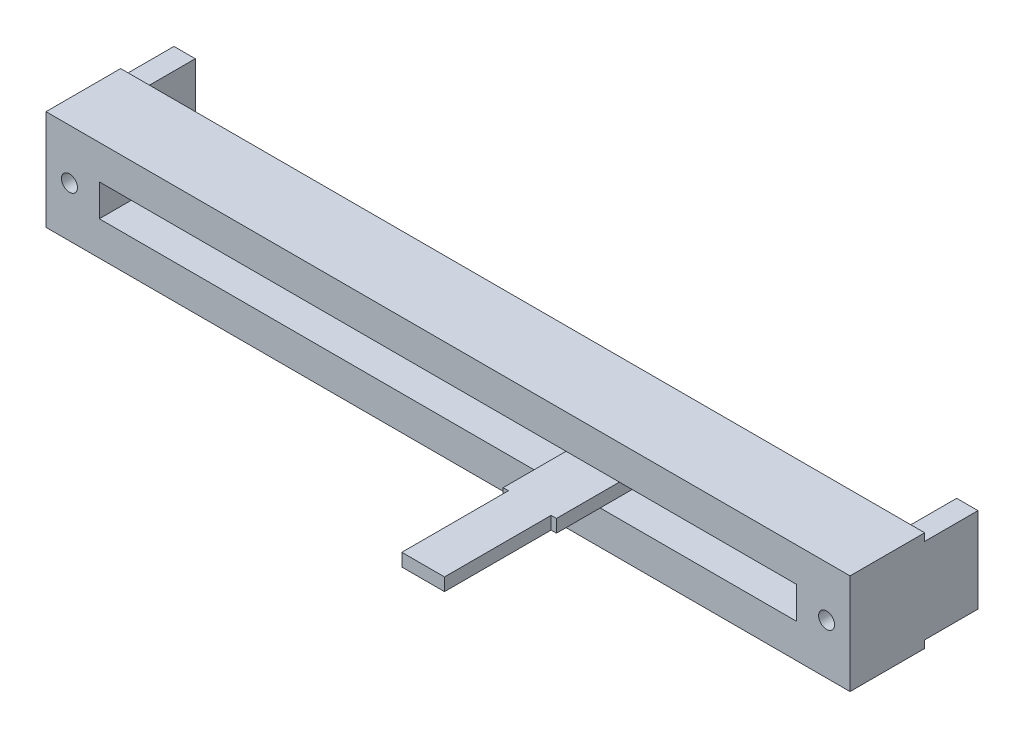
ISO-10303-21;
HEADER;
FILE_DESCRIPTION(('STEP AP214'),'2;1');
FILE_NAME('part.step','',(''),(''),'','','');
FILE_SCHEMA(('AUTOMOTIVE_DESIGN { 1 0 10303 214 1 1 1 1 }'));
ENDSEC;
DATA;
#1=APPLICATION_CONTEXT('core data for automotive mechanical design processes');
#2=APPLICATION_PROTOCOL_DEFINITION('international standard','automotive_design',2000,#1);
#3=PRODUCT_CONTEXT('',#1,'mechanical');
#4=PRODUCT('Part','Part','',(#3));
#5=PRODUCT_RELATED_PRODUCT_CATEGORY('part','',(#4));
#6=PRODUCT_DEFINITION_FORMATION('','',#4);
#7=PRODUCT_DEFINITION_CONTEXT('part definition',#1,'design');
#8=PRODUCT_DEFINITION('design','',#6,#7);
#9=PRODUCT_DEFINITION_SHAPE('','',#8);
#10=(LENGTH_UNIT() NAMED_UNIT(*) SI_UNIT(.MILLI.,.METRE.));
#11=(NAMED_UNIT(*) PLANE_ANGLE_UNIT() SI_UNIT($,.RADIAN.));
#12=(NAMED_UNIT(*) SI_UNIT($,.STERADIAN.) SOLID_ANGLE_UNIT());
#13=UNCERTAINTY_MEASURE_WITH_UNIT(LENGTH_MEASURE(1.E-05),#10,'distance_accuracy_value','');
#14=(GEOMETRIC_REPRESENTATION_CONTEXT(3) GLOBAL_UNCERTAINTY_ASSIGNED_CONTEXT((#13)) GLOBAL_UNIT_ASSIGNED_CONTEXT((#10,
#11,#12)) REPRESENTATION_CONTEXT('',''));
#15=CARTESIAN_POINT('',(0.,0.,0.));
#16=DIRECTION('',(0.,0.,1.));
#17=DIRECTION('',(1.,0.,0.));
#18=AXIS2_PLACEMENT_3D('',#15,#16,#17);
#19=CARTESIAN_POINT('',(0.,0.,0.));
#20=DIRECTION('',(0.,0.,1.));
#21=DIRECTION('',(1.,0.,0.));
#22=AXIS2_PLACEMENT_3D('',#19,#20,#21);
#23=PLANE('',#22);
#24=DIRECTION('',(1.,0.,0.));
#25=VECTOR('',#24,1.);
#26=CARTESIAN_POINT('',(-37.7,4.,0.));
#27=LINE('',#26,#25);
#28=CARTESIAN_POINT('',(-37.7,4.,0.));
#29=VERTEX_POINT('',#28);
#30=CARTESIAN_POINT('',(-35.7,4.,0.));
#31=VERTEX_POINT('',#30);
#32=EDGE_CURVE('E246',#29,#31,#27,.T.);
#33=ORIENTED_EDGE('',*,*,#32,.F.);
#34=DIRECTION('',(0.,-1.,0.));
#35=VECTOR('',#34,1.);
#36=CARTESIAN_POINT('',(-37.7,4.7,0.));
#37=LINE('',#36,#35);
#38=CARTESIAN_POINT('',(-37.7,4.7,0.));
#39=VERTEX_POINT('',#38);
#40=EDGE_CURVE('E394',#39,#29,#37,.T.);
#41=ORIENTED_EDGE('',*,*,#40,.F.);
#42=DIRECTION('',(-1.,0.,0.));
#43=VECTOR('',#42,1.);
#44=CARTESIAN_POINT('',(-37.7,4.7,0.));
#45=LINE('',#44,#43);
#46=CARTESIAN_POINT('',(37.7,4.70000000000001,0.));
#47=VERTEX_POINT('',#46);
#48=EDGE_CURVE('E384',#47,#39,#45,.T.);
#49=ORIENTED_EDGE('',*,*,#48,.F.);
#50=DIRECTION('',(0.,1.,0.));
#51=VECTOR('',#50,1.);
#52=CARTESIAN_POINT('',(37.7,4.70000000000001,0.));
#53=LINE('',#52,#51);
#54=CARTESIAN_POINT('',(37.7,4.,0.));
#55=VERTEX_POINT('',#54);
#56=EDGE_CURVE('E401',#55,#47,#53,.T.);
#57=ORIENTED_EDGE('',*,*,#56,.F.);
#58=DIRECTION('',(1.,0.,0.));
#59=VECTOR('',#58,1.);
#60=CARTESIAN_POINT('',(37.7,4.,0.));
#61=LINE('',#60,#59);
#62=CARTESIAN_POINT('',(35.7,4.,0.));
#63=VERTEX_POINT('',#62);
#64=EDGE_CURVE('E288',#63,#55,#61,.T.);
#65=ORIENTED_EDGE('',*,*,#64,.F.);
#66=DIRECTION('',(0.,1.,0.));
#67=VECTOR('',#66,1.);
#68=CARTESIAN_POINT('',(35.7,4.,0.));
#69=LINE('',#68,#67);
#70=CARTESIAN_POINT('',(35.7,-4.,0.));
#71=VERTEX_POINT('',#70);
#72=EDGE_CURVE('E301',#71,#63,#69,.T.);
#73=ORIENTED_EDGE('',*,*,#72,.F.);
#74=DIRECTION('',(-1.,0.,0.));
#75=VECTOR('',#74,1.);
#76=CARTESIAN_POINT('',(37.7,-4.,0.));
#77=LINE('',#76,#75);
#78=CARTESIAN_POINT('',(37.7,-4.,0.));
#79=VERTEX_POINT('',#78);
#80=EDGE_CURVE('E282',#79,#71,#77,.T.);
#81=ORIENTED_EDGE('',*,*,#80,.F.);
#82=CARTESIAN_POINT('',(37.7,-4.69999999999999,0.));
#83=VERTEX_POINT('',#82);
#84=EDGE_CURVE('E402',#83,#79,#53,.T.);
#85=ORIENTED_EDGE('',*,*,#84,.F.);
#86=DIRECTION('',(1.,0.,0.));
#87=VECTOR('',#86,1.);
#88=CARTESIAN_POINT('',(-37.7,-4.7,0.));
#89=LINE('',#88,#87);
#90=CARTESIAN_POINT('',(-37.7,-4.7,0.));
#91=VERTEX_POINT('',#90);
#92=EDGE_CURVE('E398',#91,#83,#89,.T.);
#93=ORIENTED_EDGE('',*,*,#92,.F.);
#94=CARTESIAN_POINT('',(-37.7,-4.,0.));
#95=VERTEX_POINT('',#94);
#96=EDGE_CURVE('E371',#95,#91,#37,.T.);
#97=ORIENTED_EDGE('',*,*,#96,.F.);
#98=DIRECTION('',(-1.,0.,0.));
#99=VECTOR('',#98,1.);
#100=CARTESIAN_POINT('',(-37.7,-4.,0.));
#101=LINE('',#100,#99);
#102=CARTESIAN_POINT('',(-35.7,-4.,0.));
#103=VERTEX_POINT('',#102);
#104=EDGE_CURVE('E260',#103,#95,#101,.T.);
#105=ORIENTED_EDGE('',*,*,#104,.F.);
#106=DIRECTION('',(0.,-1.,0.));
#107=VECTOR('',#106,1.);
#108=CARTESIAN_POINT('',(-35.7,4.,0.));
#109=LINE('',#108,#107);
#110=EDGE_CURVE('E249',#31,#103,#109,.T.);
#111=ORIENTED_EDGE('',*,*,#110,.F.);
#112=EDGE_LOOP('',(#33,#41,#49,#57,#65,#73,#81,#85,#93,#97,#105,#111));
#113=FACE_BOUND('',#112,.T.);
#114=ADVANCED_FACE('F40',(#113),#23,.F.);
#115=CARTESIAN_POINT('',(-37.7,4.7,7.));
#116=DIRECTION('',(1.,0.,0.));
#117=DIRECTION('',(0.,0.,-1.));
#118=AXIS2_PLACEMENT_3D('',#115,#116,#117);
#119=PLANE('',#118);
#120=ORIENTED_EDGE('',*,*,#40,.T.);
#121=DIRECTION('',(0.,0.,1.));
#122=VECTOR('',#121,1.);
#123=CARTESIAN_POINT('',(-37.7,4.,-5.));
#124=LINE('',#123,#122);
#125=CARTESIAN_POINT('',(-37.7,4.,-5.));
#126=VERTEX_POINT('',#125);
#127=EDGE_CURVE('E279',#126,#29,#124,.T.);
#128=ORIENTED_EDGE('',*,*,#127,.F.);
#129=DIRECTION('',(0.,1.,0.));
#130=VECTOR('',#129,1.);
#131=CARTESIAN_POINT('',(-37.7,4.,-5.));
#132=LINE('',#131,#130);
#133=CARTESIAN_POINT('',(-37.7,-4.,-5.));
#134=VERTEX_POINT('',#133);
#135=EDGE_CURVE('E255',#134,#126,#132,.T.);
#136=ORIENTED_EDGE('',*,*,#135,.F.);
#137=DIRECTION('',(0.,0.,1.));
#138=VECTOR('',#137,1.);
#139=CARTESIAN_POINT('',(-37.7,-4.,-5.));
#140=LINE('',#139,#138);
#141=EDGE_CURVE('E64',#134,#95,#140,.T.);
#142=ORIENTED_EDGE('',*,*,#141,.T.);
#143=ORIENTED_EDGE('',*,*,#96,.T.);
#144=DIRECTION('',(0.,0.,-1.));
#145=VECTOR('',#144,1.);
#146=CARTESIAN_POINT('',(-37.7,-4.7,7.));
#147=LINE('',#146,#145);
#148=CARTESIAN_POINT('',(-37.7,-4.7,7.));
#149=VERTEX_POINT('',#148);
#150=EDGE_CURVE('E419',#149,#91,#147,.T.);
#151=ORIENTED_EDGE('',*,*,#150,.F.);
#152=DIRECTION('',(0.,-1.,0.));
#153=VECTOR('',#152,1.);
#154=CARTESIAN_POINT('',(-37.7,4.7,7.));
#155=LINE('',#154,#153);
#156=CARTESIAN_POINT('',(-37.7,4.7,7.));
#157=VERTEX_POINT('',#156);
#158=EDGE_CURVE('E380',#157,#149,#155,.T.);
#159=ORIENTED_EDGE('',*,*,#158,.F.);
#160=DIRECTION('',(0.,0.,-1.));
#161=VECTOR('',#160,1.);
#162=CARTESIAN_POINT('',(-37.7,4.7,7.));
#163=LINE('',#162,#161);
#164=EDGE_CURVE('E393',#157,#39,#163,.T.);
#165=ORIENTED_EDGE('',*,*,#164,.T.);
#166=EDGE_LOOP('',(#120,#128,#136,#142,#143,#151,#159,#165));
#167=FACE_BOUND('',#166,.T.);
#168=ADVANCED_FACE('F42',(#167),#119,.F.);
#169=CARTESIAN_POINT('',(-37.7,-4.7,7.));
#170=DIRECTION('',(0.,1.,0.));
#171=DIRECTION('',(-1.,0.,0.));
#172=AXIS2_PLACEMENT_3D('',#169,#170,#171);
#173=PLANE('',#172);
#174=ORIENTED_EDGE('',*,*,#92,.T.);
#175=DIRECTION('',(0.,0.,-1.));
#176=VECTOR('',#175,1.);
#177=CARTESIAN_POINT('',(37.7,-4.69999999999999,7.));
#178=LINE('',#177,#176);
#179=CARTESIAN_POINT('',(37.7,-4.69999999999999,7.));
#180=VERTEX_POINT('',#179);
#181=EDGE_CURVE('E415',#180,#83,#178,.T.);
#182=ORIENTED_EDGE('',*,*,#181,.F.);
#183=DIRECTION('',(1.,0.,0.));
#184=VECTOR('',#183,1.);
#185=CARTESIAN_POINT('',(-37.7,-4.7,7.));
#186=LINE('',#185,#184);
#187=EDGE_CURVE('E383',#149,#180,#186,.T.);
#188=ORIENTED_EDGE('',*,*,#187,.F.);
#189=ORIENTED_EDGE('',*,*,#150,.T.);
#190=EDGE_LOOP('',(#174,#182,#188,#189));
#191=FACE_BOUND('',#190,.T.);
#192=ADVANCED_FACE('F498',(#191),#173,.F.);
#193=CARTESIAN_POINT('',(37.7,4.70000000000001,7.));
#194=DIRECTION('',(-1.,0.,0.));
#195=DIRECTION('',(0.,0.,1.));
#196=AXIS2_PLACEMENT_3D('',#193,#194,#195);
#197=PLANE('',#196);
#198=ORIENTED_EDGE('',*,*,#84,.T.);
#199=DIRECTION('',(0.,0.,1.));
#200=VECTOR('',#199,1.);
#201=CARTESIAN_POINT('',(37.7,-4.,-5.));
#202=LINE('',#201,#200);
#203=CARTESIAN_POINT('',(37.7,-4.,-5.));
#204=VERTEX_POINT('',#203);
#205=EDGE_CURVE('E319',#204,#79,#202,.T.);
#206=ORIENTED_EDGE('',*,*,#205,.F.);
#207=DIRECTION('',(0.,-1.,0.));
#208=VECTOR('',#207,1.);
#209=CARTESIAN_POINT('',(37.7,4.,-5.));
#210=LINE('',#209,#208);
#211=CARTESIAN_POINT('',(37.7,4.,-5.));
#212=VERTEX_POINT('',#211);
#213=EDGE_CURVE('E283',#212,#204,#210,.T.);
#214=ORIENTED_EDGE('',*,*,#213,.F.);
#215=DIRECTION('',(0.,0.,1.));
#216=VECTOR('',#215,1.);
#217=CARTESIAN_POINT('',(37.7,4.,-5.));
#218=LINE('',#217,#216);
#219=EDGE_CURVE('E297',#212,#55,#218,.T.);
#220=ORIENTED_EDGE('',*,*,#219,.T.);
#221=ORIENTED_EDGE('',*,*,#56,.T.);
#222=DIRECTION('',(0.,0.,-1.));
#223=VECTOR('',#222,1.);
#224=CARTESIAN_POINT('',(37.7,4.70000000000001,7.));
#225=LINE('',#224,#223);
#226=CARTESIAN_POINT('',(37.7,4.70000000000001,7.));
#227=VERTEX_POINT('',#226);
#228=EDGE_CURVE('E411',#227,#47,#225,.T.);
#229=ORIENTED_EDGE('',*,*,#228,.F.);
#230=DIRECTION('',(0.,1.,0.));
#231=VECTOR('',#230,1.);
#232=CARTESIAN_POINT('',(37.7,4.70000000000001,7.));
#233=LINE('',#232,#231);
#234=EDGE_CURVE('E387',#180,#227,#233,.T.);
#235=ORIENTED_EDGE('',*,*,#234,.F.);
#236=ORIENTED_EDGE('',*,*,#181,.T.);
#237=EDGE_LOOP('',(#198,#206,#214,#220,#221,#229,#235,#236));
#238=FACE_BOUND('',#237,.T.);
#239=ADVANCED_FACE('F507',(#238),#197,.F.);
#240=CARTESIAN_POINT('',(-37.7,4.7,7.));
#241=DIRECTION('',(0.,-1.,0.));
#242=DIRECTION('',(1.,0.,0.));
#243=AXIS2_PLACEMENT_3D('',#240,#241,#242);
#244=PLANE('',#243);
#245=ORIENTED_EDGE('',*,*,#48,.T.);
#246=ORIENTED_EDGE('',*,*,#164,.F.);
#247=DIRECTION('',(-1.,0.,0.));
#248=VECTOR('',#247,1.);
#249=CARTESIAN_POINT('',(-37.7,4.7,7.));
#250=LINE('',#249,#248);
#251=EDGE_CURVE('E390',#227,#157,#250,.T.);
#252=ORIENTED_EDGE('',*,*,#251,.F.);
#253=ORIENTED_EDGE('',*,*,#228,.T.);
#254=EDGE_LOOP('',(#245,#246,#252,#253));
#255=FACE_BOUND('',#254,.T.);
#256=ADVANCED_FACE('F504',(#255),#244,.F.);
#257=CARTESIAN_POINT('',(0.,0.,7.));
#258=DIRECTION('',(0.,0.,1.));
#259=DIRECTION('',(1.,0.,0.));
#260=AXIS2_PLACEMENT_3D('',#257,#258,#259);
#261=PLANE('',#260);
#262=CARTESIAN_POINT('',(-35.5,0.,7.));
#263=DIRECTION('',(0.,0.,1.));
#264=DIRECTION('',(1.,0.,0.));
#265=AXIS2_PLACEMENT_3D('',#262,#263,#264);
#266=CIRCLE('',#265,0.749999999999999);
#267=CARTESIAN_POINT('',(-34.75,0.,7.));
#268=VERTEX_POINT('',#267);
#269=EDGE_CURVE('E328',#268,#268,#266,.T.);
#270=ORIENTED_EDGE('',*,*,#269,.F.);
#271=EDGE_LOOP('',(#270));
#272=FACE_BOUND('',#271,.T.);
#273=CARTESIAN_POINT('',(35.5,0.,7.));
#274=DIRECTION('',(0.,0.,1.));
#275=DIRECTION('',(1.,0.,0.));
#276=AXIS2_PLACEMENT_3D('',#273,#274,#275);
#277=CIRCLE('',#276,0.749999999999999);
#278=CARTESIAN_POINT('',(36.25,0.,7.));
#279=VERTEX_POINT('',#278);
#280=EDGE_CURVE('E323',#279,#279,#277,.T.);
#281=ORIENTED_EDGE('',*,*,#280,.F.);
#282=EDGE_LOOP('',(#281));
#283=FACE_BOUND('',#282,.T.);
#284=DIRECTION('',(0.,-1.,0.));
#285=VECTOR('',#284,1.);
#286=CARTESIAN_POINT('',(-32.7,1.5,7.));
#287=LINE('',#286,#285);
#288=CARTESIAN_POINT('',(-32.7,1.5,7.));
#289=VERTEX_POINT('',#288);
#290=CARTESIAN_POINT('',(-32.7,-1.5,7.));
#291=VERTEX_POINT('',#290);
#292=EDGE_CURVE('E327',#289,#291,#287,.T.);
#293=ORIENTED_EDGE('',*,*,#292,.F.);
#294=DIRECTION('',(-1.,0.,0.));
#295=VECTOR('',#294,1.);
#296=CARTESIAN_POINT('',(-32.7,1.5,7.));
#297=LINE('',#296,#295);
#298=CARTESIAN_POINT('',(32.7,1.49999999999999,7.));
#299=VERTEX_POINT('',#298);
#300=EDGE_CURVE('E343',#299,#289,#297,.T.);
#301=ORIENTED_EDGE('',*,*,#300,.F.);
#302=DIRECTION('',(0.,1.,0.));
#303=VECTOR('',#302,1.);
#304=CARTESIAN_POINT('',(32.7,1.49999999999999,7.));
#305=LINE('',#304,#303);
#306=CARTESIAN_POINT('',(32.7,-1.49999999999999,7.));
#307=VERTEX_POINT('',#306);
#308=EDGE_CURVE('E361',#307,#299,#305,.T.);
#309=ORIENTED_EDGE('',*,*,#308,.F.);
#310=DIRECTION('',(1.,0.,0.));
#311=VECTOR('',#310,1.);
#312=CARTESIAN_POINT('',(-32.7,-1.5,7.));
#313=LINE('',#312,#311);
#314=EDGE_CURVE('E357',#291,#307,#313,.T.);
#315=ORIENTED_EDGE('',*,*,#314,.F.);
#316=EDGE_LOOP('',(#293,#301,#309,#315));
#317=FACE_BOUND('',#316,.T.);
#318=ORIENTED_EDGE('',*,*,#158,.T.);
#319=ORIENTED_EDGE('',*,*,#187,.T.);
#320=ORIENTED_EDGE('',*,*,#234,.T.);
#321=ORIENTED_EDGE('',*,*,#251,.T.);
#322=EDGE_LOOP('',(#318,#319,#320,#321));
#323=FACE_BOUND('',#322,.T.);
#324=ADVANCED_FACE('F502',(#272,#283,#317,#323),#261,.T.);
#325=CARTESIAN_POINT('',(-32.7,1.5,2.));
#326=DIRECTION('',(-1.,0.,0.));
#327=DIRECTION('',(0.,0.,1.));
#328=AXIS2_PLACEMENT_3D('',#325,#326,#327);
#329=PLANE('',#328);
#330=ORIENTED_EDGE('',*,*,#292,.T.);
#331=DIRECTION('',(0.,0.,1.));
#332=VECTOR('',#331,1.);
#333=CARTESIAN_POINT('',(-32.7,-1.5,2.));
#334=LINE('',#333,#332);
#335=CARTESIAN_POINT('',(-32.7,-1.5,2.));
#336=VERTEX_POINT('',#335);
#337=EDGE_CURVE('E355',#336,#291,#334,.T.);
#338=ORIENTED_EDGE('',*,*,#337,.F.);
#339=DIRECTION('',(0.,-1.,0.));
#340=VECTOR('',#339,1.);
#341=CARTESIAN_POINT('',(-32.7,1.5,2.));
#342=LINE('',#341,#340);
#343=CARTESIAN_POINT('',(-32.7,1.5,2.));
#344=VERTEX_POINT('',#343);
#345=EDGE_CURVE('E338',#344,#336,#342,.T.);
#346=ORIENTED_EDGE('',*,*,#345,.F.);
#347=DIRECTION('',(0.,0.,1.));
#348=VECTOR('',#347,1.);
#349=CARTESIAN_POINT('',(-32.7,1.5,2.));
#350=LINE('',#349,#348);
#351=EDGE_CURVE('E368',#344,#289,#350,.T.);
#352=ORIENTED_EDGE('',*,*,#351,.T.);
#353=EDGE_LOOP('',(#330,#338,#346,#352));
#354=FACE_BOUND('',#353,.T.);
#355=ADVANCED_FACE('F546',(#354),#329,.F.);
#356=CARTESIAN_POINT('',(-32.7,1.5,2.));
#357=DIRECTION('',(0.,1.,0.));
#358=DIRECTION('',(-1.,0.,0.));
#359=AXIS2_PLACEMENT_3D('',#356,#357,#358);
#360=PLANE('',#359);
#361=ORIENTED_EDGE('',*,*,#300,.T.);
#362=ORIENTED_EDGE('',*,*,#351,.F.);
#363=DIRECTION('',(-1.,0.,0.));
#364=VECTOR('',#363,1.);
#365=CARTESIAN_POINT('',(-32.7,1.5,2.));
#366=LINE('',#365,#364);
#367=CARTESIAN_POINT('',(32.7,1.49999999999999,2.));
#368=VERTEX_POINT('',#367);
#369=EDGE_CURVE('E351',#368,#344,#366,.T.);
#370=ORIENTED_EDGE('',*,*,#369,.F.);
#371=DIRECTION('',(0.,0.,1.));
#372=VECTOR('',#371,1.);
#373=CARTESIAN_POINT('',(32.7,1.49999999999999,2.));
#374=LINE('',#373,#372);
#375=EDGE_CURVE('E372',#368,#299,#374,.T.);
#376=ORIENTED_EDGE('',*,*,#375,.T.);
#377=EDGE_LOOP('',(#361,#362,#370,#376));
#378=FACE_BOUND('',#377,.T.);
#379=ADVANCED_FACE('F551',(#378),#360,.F.);
#380=CARTESIAN_POINT('',(32.7,1.49999999999999,2.));
#381=DIRECTION('',(1.,0.,0.));
#382=DIRECTION('',(0.,0.,-1.));
#383=AXIS2_PLACEMENT_3D('',#380,#381,#382);
#384=PLANE('',#383);
#385=ORIENTED_EDGE('',*,*,#308,.T.);
#386=ORIENTED_EDGE('',*,*,#375,.F.);
#387=DIRECTION('',(0.,1.,0.));
#388=VECTOR('',#387,1.);
#389=CARTESIAN_POINT('',(32.7,1.49999999999999,2.));
#390=LINE('',#389,#388);
#391=CARTESIAN_POINT('',(32.7,-1.49999999999999,2.));
#392=VERTEX_POINT('',#391);
#393=EDGE_CURVE('E347',#392,#368,#390,.T.);
#394=ORIENTED_EDGE('',*,*,#393,.F.);
#395=DIRECTION('',(0.,0.,1.));
#396=VECTOR('',#395,1.);
#397=CARTESIAN_POINT('',(32.7,-1.49999999999999,2.));
#398=LINE('',#397,#396);
#399=EDGE_CURVE('E375',#392,#307,#398,.T.);
#400=ORIENTED_EDGE('',*,*,#399,.T.);
#401=EDGE_LOOP('',(#385,#386,#394,#400));
#402=FACE_BOUND('',#401,.T.);
#403=ADVANCED_FACE('F569',(#402),#384,.F.);
#404=CARTESIAN_POINT('',(-32.7,-1.5,2.));
#405=DIRECTION('',(0.,-1.,0.));
#406=DIRECTION('',(1.,0.,0.));
#407=AXIS2_PLACEMENT_3D('',#404,#405,#406);
#408=PLANE('',#407);
#409=ORIENTED_EDGE('',*,*,#314,.T.);
#410=ORIENTED_EDGE('',*,*,#399,.F.);
#411=DIRECTION('',(1.,0.,0.));
#412=VECTOR('',#411,1.);
#413=CARTESIAN_POINT('',(-32.7,-1.5,2.));
#414=LINE('',#413,#412);
#415=EDGE_CURVE('E342',#336,#392,#414,.T.);
#416=ORIENTED_EDGE('',*,*,#415,.F.);
#417=ORIENTED_EDGE('',*,*,#337,.T.);
#418=EDGE_LOOP('',(#409,#410,#416,#417));
#419=FACE_BOUND('',#418,.T.);
#420=ADVANCED_FACE('F564',(#419),#408,.F.);
#421=CARTESIAN_POINT('',(0.,0.,2.));
#422=DIRECTION('',(0.,0.,1.));
#423=DIRECTION('',(1.,0.,0.));
#424=AXIS2_PLACEMENT_3D('',#421,#422,#423);
#425=PLANE('',#424);
#426=DIRECTION('',(-1.,0.,0.));
#427=VECTOR('',#426,1.);
#428=CARTESIAN_POINT('',(0.,0.6,2.));
#429=LINE('',#428,#427);
#430=CARTESIAN_POINT('',(15.1693235158385,0.6,2.));
#431=VERTEX_POINT('',#430);
#432=CARTESIAN_POINT('',(10.1693235158385,0.6,2.));
#433=VERTEX_POINT('',#432);
#434=EDGE_CURVE('E11',#431,#433,#429,.T.);
#435=ORIENTED_EDGE('',*,*,#434,.F.);
#436=DIRECTION('',(0.,-1.,0.));
#437=VECTOR('',#436,1.);
#438=CARTESIAN_POINT('',(15.1693235158385,0.,2.));
#439=LINE('',#438,#437);
#440=CARTESIAN_POINT('',(15.1693235158385,-0.6,2.));
#441=VERTEX_POINT('',#440);
#442=EDGE_CURVE('E426',#431,#441,#439,.T.);
#443=ORIENTED_EDGE('',*,*,#442,.T.);
#444=DIRECTION('',(-1.,0.,0.));
#445=VECTOR('',#444,1.);
#446=CARTESIAN_POINT('',(0.,-0.6,2.));
#447=LINE('',#446,#445);
#448=CARTESIAN_POINT('',(10.1693235158385,-0.6,2.));
#449=VERTEX_POINT('',#448);
#450=EDGE_CURVE('E422',#441,#449,#447,.T.);
#451=ORIENTED_EDGE('',*,*,#450,.T.);
#452=DIRECTION('',(0.,1.,0.));
#453=VECTOR('',#452,1.);
#454=CARTESIAN_POINT('',(10.1693235158385,0.,2.));
#455=LINE('',#454,#453);
#456=EDGE_CURVE('E49',#449,#433,#455,.T.);
#457=ORIENTED_EDGE('',*,*,#456,.T.);
#458=EDGE_LOOP('',(#435,#443,#451,#457));
#459=FACE_BOUND('',#458,.T.);
#460=ORIENTED_EDGE('',*,*,#345,.T.);
#461=ORIENTED_EDGE('',*,*,#415,.T.);
#462=ORIENTED_EDGE('',*,*,#393,.T.);
#463=ORIENTED_EDGE('',*,*,#369,.T.);
#464=EDGE_LOOP('',(#460,#461,#462,#463));
#465=FACE_BOUND('',#464,.T.);
#466=ADVANCED_FACE('F430',(#459,#465),#425,.T.);
#467=CARTESIAN_POINT('',(35.5,0.,2.));
#468=DIRECTION('',(0.,0.,1.));
#469=DIRECTION('',(1.,0.,0.));
#470=AXIS2_PLACEMENT_3D('',#467,#468,#469);
#471=CYLINDRICAL_SURFACE('',#470,0.749999999999999);
#472=CARTESIAN_POINT('',(35.5,0.,2.));
#473=DIRECTION('',(0.,0.,1.));
#474=DIRECTION('',(1.,0.,0.));
#475=AXIS2_PLACEMENT_3D('',#472,#473,#474);
#476=CIRCLE('',#475,0.749999999999999);
#477=CARTESIAN_POINT('',(36.25,0.,2.));
#478=VERTEX_POINT('',#477);
#479=EDGE_CURVE('E331',#478,#478,#476,.T.);
#480=ORIENTED_EDGE('',*,*,#479,.F.);
#481=EDGE_LOOP('',(#480));
#482=FACE_BOUND('',#481,.T.);
#483=ORIENTED_EDGE('',*,*,#280,.T.);
#484=EDGE_LOOP('',(#483));
#485=FACE_BOUND('',#484,.T.);
#486=ADVANCED_FACE('F581',(#482,#485),#471,.F.);
#487=CARTESIAN_POINT('',(35.5,0.,2.));
#488=DIRECTION('',(0.,0.,1.));
#489=DIRECTION('',(1.,0.,0.));
#490=AXIS2_PLACEMENT_3D('',#487,#488,#489);
#491=PLANE('',#490);
#492=ORIENTED_EDGE('',*,*,#479,.T.);
#493=EDGE_LOOP('',(#492));
#494=FACE_BOUND('',#493,.T.);
#495=ADVANCED_FACE('F584',(#494),#491,.T.);
#496=CARTESIAN_POINT('',(-35.5,0.,2.));
#497=DIRECTION('',(0.,0.,1.));
#498=DIRECTION('',(1.,0.,0.));
#499=AXIS2_PLACEMENT_3D('',#496,#497,#498);
#500=CYLINDRICAL_SURFACE('',#499,0.749999999999999);
#501=CARTESIAN_POINT('',(-35.5,0.,2.));
#502=DIRECTION('',(0.,0.,1.));
#503=DIRECTION('',(1.,0.,0.));
#504=AXIS2_PLACEMENT_3D('',#501,#502,#503);
#505=CIRCLE('',#504,0.749999999999999);
#506=CARTESIAN_POINT('',(-34.75,0.,2.));
#507=VERTEX_POINT('',#506);
#508=EDGE_CURVE('E324',#507,#507,#505,.T.);
#509=ORIENTED_EDGE('',*,*,#508,.F.);
#510=EDGE_LOOP('',(#509));
#511=FACE_BOUND('',#510,.T.);
#512=ORIENTED_EDGE('',*,*,#269,.T.);
#513=EDGE_LOOP('',(#512));
#514=FACE_BOUND('',#513,.T.);
#515=ADVANCED_FACE('F588',(#511,#514),#500,.F.);
#516=CARTESIAN_POINT('',(-35.5,0.,2.));
#517=DIRECTION('',(0.,0.,1.));
#518=DIRECTION('',(1.,0.,0.));
#519=AXIS2_PLACEMENT_3D('',#516,#517,#518);
#520=PLANE('',#519);
#521=ORIENTED_EDGE('',*,*,#508,.T.);
#522=EDGE_LOOP('',(#521));
#523=FACE_BOUND('',#522,.T.);
#524=ADVANCED_FACE('F592',(#523),#520,.T.);
#525=CARTESIAN_POINT('',(37.7,-4.,-5.));
#526=DIRECTION('',(0.,1.,0.));
#527=DIRECTION('',(0.,0.,1.));
#528=AXIS2_PLACEMENT_3D('',#525,#526,#527);
#529=PLANE('',#528);
#530=ORIENTED_EDGE('',*,*,#80,.T.);
#531=DIRECTION('',(0.,0.,1.));
#532=VECTOR('',#531,1.);
#533=CARTESIAN_POINT('',(35.7,-4.,-5.));
#534=LINE('',#533,#532);
#535=CARTESIAN_POINT('',(35.7,-4.,-5.));
#536=VERTEX_POINT('',#535);
#537=EDGE_CURVE('E315',#536,#71,#534,.T.);
#538=ORIENTED_EDGE('',*,*,#537,.F.);
#539=DIRECTION('',(-1.,0.,0.));
#540=VECTOR('',#539,1.);
#541=CARTESIAN_POINT('',(37.7,-4.,-5.));
#542=LINE('',#541,#540);
#543=EDGE_CURVE('E287',#204,#536,#542,.T.);
#544=ORIENTED_EDGE('',*,*,#543,.F.);
#545=ORIENTED_EDGE('',*,*,#205,.T.);
#546=EDGE_LOOP('',(#530,#538,#544,#545));
#547=FACE_BOUND('',#546,.T.);
#548=ADVANCED_FACE('F525',(#547),#529,.F.);
#549=CARTESIAN_POINT('',(35.7,4.,-5.));
#550=DIRECTION('',(1.,0.,0.));
#551=DIRECTION('',(0.,0.,-1.));
#552=AXIS2_PLACEMENT_3D('',#549,#550,#551);
#553=PLANE('',#552);
#554=ORIENTED_EDGE('',*,*,#72,.T.);
#555=DIRECTION('',(0.,0.,1.));
#556=VECTOR('',#555,1.);
#557=CARTESIAN_POINT('',(35.7,4.,-5.));
#558=LINE('',#557,#556);
#559=CARTESIAN_POINT('',(35.7,4.,-5.));
#560=VERTEX_POINT('',#559);
#561=EDGE_CURVE('E311',#560,#63,#558,.T.);
#562=ORIENTED_EDGE('',*,*,#561,.F.);
#563=DIRECTION('',(0.,1.,0.));
#564=VECTOR('',#563,1.);
#565=CARTESIAN_POINT('',(35.7,4.,-5.));
#566=LINE('',#565,#564);
#567=EDGE_CURVE('E291',#536,#560,#566,.T.);
#568=ORIENTED_EDGE('',*,*,#567,.F.);
#569=ORIENTED_EDGE('',*,*,#537,.T.);
#570=EDGE_LOOP('',(#554,#562,#568,#569));
#571=FACE_BOUND('',#570,.T.);
#572=ADVANCED_FACE('F528',(#571),#553,.F.);
#573=CARTESIAN_POINT('',(37.7,4.,-5.));
#574=DIRECTION('',(0.,-1.,0.));
#575=DIRECTION('',(0.,0.,-1.));
#576=AXIS2_PLACEMENT_3D('',#573,#574,#575);
#577=PLANE('',#576);
#578=ORIENTED_EDGE('',*,*,#64,.T.);
#579=ORIENTED_EDGE('',*,*,#219,.F.);
#580=DIRECTION('',(1.,0.,0.));
#581=VECTOR('',#580,1.);
#582=CARTESIAN_POINT('',(37.7,4.,-5.));
#583=LINE('',#582,#581);
#584=EDGE_CURVE('E294',#560,#212,#583,.T.);
#585=ORIENTED_EDGE('',*,*,#584,.F.);
#586=ORIENTED_EDGE('',*,*,#561,.T.);
#587=EDGE_LOOP('',(#578,#579,#585,#586));
#588=FACE_BOUND('',#587,.T.);
#589=ADVANCED_FACE('F536',(#588),#577,.F.);
#590=CARTESIAN_POINT('',(0.,0.,-5.));
#591=DIRECTION('',(0.,0.,-1.));
#592=DIRECTION('',(-1.,0.,0.));
#593=AXIS2_PLACEMENT_3D('',#590,#591,#592);
#594=PLANE('',#593);
#595=ORIENTED_EDGE('',*,*,#213,.T.);
#596=ORIENTED_EDGE('',*,*,#543,.T.);
#597=ORIENTED_EDGE('',*,*,#567,.T.);
#598=ORIENTED_EDGE('',*,*,#584,.T.);
#599=EDGE_LOOP('',(#595,#596,#597,#598));
#600=FACE_BOUND('',#599,.T.);
#601=ADVANCED_FACE('F532',(#600),#594,.T.);
#602=CARTESIAN_POINT('',(-37.7,4.,-5.));
#603=DIRECTION('',(0.,-1.,0.));
#604=DIRECTION('',(0.,0.,-1.));
#605=AXIS2_PLACEMENT_3D('',#602,#603,#604);
#606=PLANE('',#605);
#607=ORIENTED_EDGE('',*,*,#32,.T.);
#608=DIRECTION('',(0.,0.,1.));
#609=VECTOR('',#608,1.);
#610=CARTESIAN_POINT('',(-35.7,4.,-5.));
#611=LINE('',#610,#609);
#612=CARTESIAN_POINT('',(-35.7,4.,-5.));
#613=VERTEX_POINT('',#612);
#614=EDGE_CURVE('E275',#613,#31,#611,.T.);
#615=ORIENTED_EDGE('',*,*,#614,.F.);
#616=DIRECTION('',(1.,0.,0.));
#617=VECTOR('',#616,1.);
#618=CARTESIAN_POINT('',(-37.7,4.,-5.));
#619=LINE('',#618,#617);
#620=EDGE_CURVE('E259',#126,#613,#619,.T.);
#621=ORIENTED_EDGE('',*,*,#620,.F.);
#622=ORIENTED_EDGE('',*,*,#127,.T.);
#623=EDGE_LOOP('',(#607,#615,#621,#622));
#624=FACE_BOUND('',#623,.T.);
#625=ADVANCED_FACE('F605',(#624),#606,.F.);
#626=CARTESIAN_POINT('',(-35.7,4.,-5.));
#627=DIRECTION('',(-1.,0.,0.));
#628=DIRECTION('',(0.,0.,1.));
#629=AXIS2_PLACEMENT_3D('',#626,#627,#628);
#630=PLANE('',#629);
#631=ORIENTED_EDGE('',*,*,#110,.T.);
#632=DIRECTION('',(0.,0.,1.));
#633=VECTOR('',#632,1.);
#634=CARTESIAN_POINT('',(-35.7,-4.,-5.));
#635=LINE('',#634,#633);
#636=CARTESIAN_POINT('',(-35.7,-4.,-5.));
#637=VERTEX_POINT('',#636);
#638=EDGE_CURVE('E272',#637,#103,#635,.T.);
#639=ORIENTED_EDGE('',*,*,#638,.F.);
#640=DIRECTION('',(0.,-1.,0.));
#641=VECTOR('',#640,1.);
#642=CARTESIAN_POINT('',(-35.7,4.,-5.));
#643=LINE('',#642,#641);
#644=EDGE_CURVE('E263',#613,#637,#643,.T.);
#645=ORIENTED_EDGE('',*,*,#644,.F.);
#646=ORIENTED_EDGE('',*,*,#614,.T.);
#647=EDGE_LOOP('',(#631,#639,#645,#646));
#648=FACE_BOUND('',#647,.T.);
#649=ADVANCED_FACE('F608',(#648),#630,.F.);
#650=CARTESIAN_POINT('',(-37.7,-4.,-5.));
#651=DIRECTION('',(0.,1.,0.));
#652=DIRECTION('',(0.,0.,1.));
#653=AXIS2_PLACEMENT_3D('',#650,#651,#652);
#654=PLANE('',#653);
#655=ORIENTED_EDGE('',*,*,#104,.T.);
#656=ORIENTED_EDGE('',*,*,#141,.F.);
#657=DIRECTION('',(-1.,0.,0.));
#658=VECTOR('',#657,1.);
#659=CARTESIAN_POINT('',(-37.7,-4.,-5.));
#660=LINE('',#659,#658);
#661=EDGE_CURVE('E266',#637,#134,#660,.T.);
#662=ORIENTED_EDGE('',*,*,#661,.F.);
#663=ORIENTED_EDGE('',*,*,#638,.T.);
#664=EDGE_LOOP('',(#655,#656,#662,#663));
#665=FACE_BOUND('',#664,.T.);
#666=ADVANCED_FACE('F612',(#665),#654,.F.);
#667=CARTESIAN_POINT('',(0.,0.,-5.));
#668=DIRECTION('',(0.,0.,1.));
#669=DIRECTION('',(1.,0.,0.));
#670=AXIS2_PLACEMENT_3D('',#667,#668,#669);
#671=PLANE('',#670);
#672=ORIENTED_EDGE('',*,*,#135,.T.);
#673=ORIENTED_EDGE('',*,*,#620,.T.);
#674=ORIENTED_EDGE('',*,*,#644,.T.);
#675=ORIENTED_EDGE('',*,*,#661,.T.);
#676=EDGE_LOOP('',(#672,#673,#674,#675));
#677=FACE_BOUND('',#676,.T.);
#678=ADVANCED_FACE('F616',(#677),#671,.F.);
#679=CARTESIAN_POINT('',(10.1693235158385,0.6,0.));
#680=DIRECTION('',(1.,0.,0.));
#681=DIRECTION('',(0.,0.,-1.));
#682=AXIS2_PLACEMENT_3D('',#679,#680,#681);
#683=PLANE('',#682);
#684=ORIENTED_EDGE('',*,*,#456,.F.);
#685=DIRECTION('',(0.,0.,1.));
#686=VECTOR('',#685,1.);
#687=CARTESIAN_POINT('',(10.1693235158385,-0.6,0.));
#688=LINE('',#687,#686);
#689=CARTESIAN_POINT('',(10.1693235158385,-0.6,12.));
#690=VERTEX_POINT('',#689);
#691=EDGE_CURVE('E56',#449,#690,#688,.T.);
#692=ORIENTED_EDGE('',*,*,#691,.T.);
#693=DIRECTION('',(0.,-1.,0.));
#694=VECTOR('',#693,1.);
#695=CARTESIAN_POINT('',(10.1693235158385,0.6,12.));
#696=LINE('',#695,#694);
#697=CARTESIAN_POINT('',(10.1693235158385,0.6,12.));
#698=VERTEX_POINT('',#697);
#699=EDGE_CURVE('E239',#698,#690,#696,.T.);
#700=ORIENTED_EDGE('',*,*,#699,.F.);
#701=DIRECTION('',(0.,0.,1.));
#702=VECTOR('',#701,1.);
#703=CARTESIAN_POINT('',(10.1693235158385,0.6,0.));
#704=LINE('',#703,#702);
#705=EDGE_CURVE('E224',#433,#698,#704,.T.);
#706=ORIENTED_EDGE('',*,*,#705,.F.);
#707=EDGE_LOOP('',(#684,#692,#700,#706));
#708=FACE_BOUND('',#707,.T.);
#709=ADVANCED_FACE('F245',(#708),#683,.F.);
#710=CARTESIAN_POINT('',(10.1693235158385,0.6,12.));
#711=DIRECTION('',(0.,0.,-1.));
#712=DIRECTION('',(-1.,0.,0.));
#713=AXIS2_PLACEMENT_3D('',#710,#711,#712);
#714=PLANE('',#713);
#715=DIRECTION('',(1.,0.,0.));
#716=VECTOR('',#715,1.);
#717=CARTESIAN_POINT('',(10.1693235158385,-0.6,12.));
#718=LINE('',#717,#716);
#719=CARTESIAN_POINT('',(10.6693235158385,-0.6,12.));
#720=VERTEX_POINT('',#719);
#721=EDGE_CURVE('E470',#690,#720,#718,.T.);
#722=ORIENTED_EDGE('',*,*,#721,.T.);
#723=DIRECTION('',(0.,-1.,0.));
#724=VECTOR('',#723,1.);
#725=CARTESIAN_POINT('',(10.6693235158385,0.6,12.));
#726=LINE('',#725,#724);
#727=CARTESIAN_POINT('',(10.6693235158385,0.6,12.));
#728=VERTEX_POINT('',#727);
#729=EDGE_CURVE('E241',#728,#720,#726,.T.);
#730=ORIENTED_EDGE('',*,*,#729,.F.);
#731=DIRECTION('',(1.,0.,0.));
#732=VECTOR('',#731,1.);
#733=CARTESIAN_POINT('',(10.1693235158385,0.6,12.));
#734=LINE('',#733,#732);
#735=EDGE_CURVE('E228',#698,#728,#734,.T.);
#736=ORIENTED_EDGE('',*,*,#735,.F.);
#737=ORIENTED_EDGE('',*,*,#699,.T.);
#738=EDGE_LOOP('',(#722,#730,#736,#737));
#739=FACE_BOUND('',#738,.T.);
#740=ADVANCED_FACE('F238',(#739),#714,.F.);
#741=CARTESIAN_POINT('',(10.6693235158385,0.6,12.));
#742=DIRECTION('',(1.,0.,0.));
#743=DIRECTION('',(0.,0.,-1.));
#744=AXIS2_PLACEMENT_3D('',#741,#742,#743);
#745=PLANE('',#744);
#746=DIRECTION('',(0.,0.,1.));
#747=VECTOR('',#746,1.);
#748=CARTESIAN_POINT('',(10.6693235158385,-0.6,12.));
#749=LINE('',#748,#747);
#750=CARTESIAN_POINT('',(10.6693235158385,-0.6,22.));
#751=VERTEX_POINT('',#750);
#752=EDGE_CURVE('E468',#720,#751,#749,.T.);
#753=ORIENTED_EDGE('',*,*,#752,.T.);
#754=DIRECTION('',(0.,-1.,0.));
#755=VECTOR('',#754,1.);
#756=CARTESIAN_POINT('',(10.6693235158385,0.6,22.));
#757=LINE('',#756,#755);
#758=CARTESIAN_POINT('',(10.6693235158385,0.6,22.));
#759=VERTEX_POINT('',#758);
#760=EDGE_CURVE('E251',#759,#751,#757,.T.);
#761=ORIENTED_EDGE('',*,*,#760,.F.);
#762=DIRECTION('',(0.,0.,1.));
#763=VECTOR('',#762,1.);
#764=CARTESIAN_POINT('',(10.6693235158385,0.6,12.));
#765=LINE('',#764,#763);
#766=EDGE_CURVE('E243',#728,#759,#765,.T.);
#767=ORIENTED_EDGE('',*,*,#766,.F.);
#768=ORIENTED_EDGE('',*,*,#729,.T.);
#769=EDGE_LOOP('',(#753,#761,#767,#768));
#770=FACE_BOUND('',#769,.T.);
#771=ADVANCED_FACE('F482',(#770),#745,.F.);
#772=CARTESIAN_POINT('',(10.6693235158385,0.6,22.));
#773=DIRECTION('',(0.,0.,-1.));
#774=DIRECTION('',(-1.,0.,0.));
#775=AXIS2_PLACEMENT_3D('',#772,#773,#774);
#776=PLANE('',#775);
#777=DIRECTION('',(1.,0.,0.));
#778=VECTOR('',#777,1.);
#779=CARTESIAN_POINT('',(10.6693235158385,-0.6,22.));
#780=LINE('',#779,#778);
#781=CARTESIAN_POINT('',(14.6693235158385,-0.6,22.));
#782=VERTEX_POINT('',#781);
#783=EDGE_CURVE('E463',#751,#782,#780,.T.);
#784=ORIENTED_EDGE('',*,*,#783,.T.);
#785=DIRECTION('',(0.,-1.,0.));
#786=VECTOR('',#785,1.);
#787=CARTESIAN_POINT('',(14.6693235158385,0.6,22.));
#788=LINE('',#787,#786);
#789=CARTESIAN_POINT('',(14.6693235158385,0.6,22.));
#790=VERTEX_POINT('',#789);
#791=EDGE_CURVE('E454',#790,#782,#788,.T.);
#792=ORIENTED_EDGE('',*,*,#791,.F.);
#793=DIRECTION('',(1.,0.,0.));
#794=VECTOR('',#793,1.);
#795=CARTESIAN_POINT('',(10.6693235158385,0.6,22.));
#796=LINE('',#795,#794);
#797=EDGE_CURVE('E464',#759,#790,#796,.T.);
#798=ORIENTED_EDGE('',*,*,#797,.F.);
#799=ORIENTED_EDGE('',*,*,#760,.T.);
#800=EDGE_LOOP('',(#784,#792,#798,#799));
#801=FACE_BOUND('',#800,.T.);
#802=ADVANCED_FACE('F461',(#801),#776,.F.);
#803=CARTESIAN_POINT('',(14.6693235158385,0.6,12.));
#804=DIRECTION('',(-1.,0.,0.));
#805=DIRECTION('',(0.,0.,1.));
#806=AXIS2_PLACEMENT_3D('',#803,#804,#805);
#807=PLANE('',#806);
#808=DIRECTION('',(0.,0.,-1.));
#809=VECTOR('',#808,1.);
#810=CARTESIAN_POINT('',(14.6693235158385,-0.6,12.));
#811=LINE('',#810,#809);
#812=CARTESIAN_POINT('',(14.6693235158385,-0.6,12.));
#813=VERTEX_POINT('',#812);
#814=EDGE_CURVE('E445',#782,#813,#811,.T.);
#815=ORIENTED_EDGE('',*,*,#814,.T.);
#816=DIRECTION('',(0.,-1.,0.));
#817=VECTOR('',#816,1.);
#818=CARTESIAN_POINT('',(14.6693235158385,0.6,12.));
#819=LINE('',#818,#817);
#820=CARTESIAN_POINT('',(14.6693235158385,0.6,12.));
#821=VERTEX_POINT('',#820);
#822=EDGE_CURVE('E450',#821,#813,#819,.T.);
#823=ORIENTED_EDGE('',*,*,#822,.F.);
#824=DIRECTION('',(0.,0.,-1.));
#825=VECTOR('',#824,1.);
#826=CARTESIAN_POINT('',(14.6693235158385,0.6,12.));
#827=LINE('',#826,#825);
#828=EDGE_CURVE('E479',#790,#821,#827,.T.);
#829=ORIENTED_EDGE('',*,*,#828,.F.);
#830=ORIENTED_EDGE('',*,*,#791,.T.);
#831=EDGE_LOOP('',(#815,#823,#829,#830));
#832=FACE_BOUND('',#831,.T.);
#833=ADVANCED_FACE('F489',(#832),#807,.F.);
#834=CARTESIAN_POINT('',(14.6693235158385,0.6,12.));
#835=DIRECTION('',(0.,0.,-1.));
#836=DIRECTION('',(-1.,0.,0.));
#837=AXIS2_PLACEMENT_3D('',#834,#835,#836);
#838=PLANE('',#837);
#839=DIRECTION('',(1.,0.,0.));
#840=VECTOR('',#839,1.);
#841=CARTESIAN_POINT('',(14.6693235158385,-0.6,12.));
#842=LINE('',#841,#840);
#843=CARTESIAN_POINT('',(15.1693235158385,-0.6,12.));
#844=VERTEX_POINT('',#843);
#845=EDGE_CURVE('E443',#813,#844,#842,.T.);
#846=ORIENTED_EDGE('',*,*,#845,.T.);
#847=DIRECTION('',(0.,-1.,0.));
#848=VECTOR('',#847,1.);
#849=CARTESIAN_POINT('',(15.1693235158385,0.6,12.));
#850=LINE('',#849,#848);
#851=CARTESIAN_POINT('',(15.1693235158385,0.6,12.));
#852=VERTEX_POINT('',#851);
#853=EDGE_CURVE('E441',#852,#844,#850,.T.);
#854=ORIENTED_EDGE('',*,*,#853,.F.);
#855=DIRECTION('',(1.,0.,0.));
#856=VECTOR('',#855,1.);
#857=CARTESIAN_POINT('',(14.6693235158385,0.6,12.));
#858=LINE('',#857,#856);
#859=EDGE_CURVE('E477',#821,#852,#858,.T.);
#860=ORIENTED_EDGE('',*,*,#859,.F.);
#861=ORIENTED_EDGE('',*,*,#822,.T.);
#862=EDGE_LOOP('',(#846,#854,#860,#861));
#863=FACE_BOUND('',#862,.T.);
#864=ADVANCED_FACE('F650',(#863),#838,.F.);
#865=CARTESIAN_POINT('',(15.1693235158385,0.6,0.));
#866=DIRECTION('',(-1.,0.,0.));
#867=DIRECTION('',(0.,0.,1.));
#868=AXIS2_PLACEMENT_3D('',#865,#866,#867);
#869=PLANE('',#868);
#870=ORIENTED_EDGE('',*,*,#442,.F.);
#871=DIRECTION('',(0.,0.,-1.));
#872=VECTOR('',#871,1.);
#873=CARTESIAN_POINT('',(15.1693235158385,0.6,0.));
#874=LINE('',#873,#872);
#875=EDGE_CURVE('E451',#852,#431,#874,.T.);
#876=ORIENTED_EDGE('',*,*,#875,.F.);
#877=ORIENTED_EDGE('',*,*,#853,.T.);
#878=DIRECTION('',(0.,0.,-1.));
#879=VECTOR('',#878,1.);
#880=CARTESIAN_POINT('',(15.1693235158385,-0.6,0.));
#881=LINE('',#880,#879);
#882=EDGE_CURVE('E234',#844,#441,#881,.T.);
#883=ORIENTED_EDGE('',*,*,#882,.T.);
#884=EDGE_LOOP('',(#870,#876,#877,#883));
#885=FACE_BOUND('',#884,.T.);
#886=ADVANCED_FACE('F438',(#885),#869,.F.);
#887=CARTESIAN_POINT('',(0.,0.6,0.));
#888=DIRECTION('',(0.,1.,0.));
#889=DIRECTION('',(0.,0.,1.));
#890=AXIS2_PLACEMENT_3D('',#887,#888,#889);
#891=PLANE('',#890);
#892=ORIENTED_EDGE('',*,*,#875,.T.);
#893=ORIENTED_EDGE('',*,*,#434,.T.);
#894=ORIENTED_EDGE('',*,*,#705,.T.);
#895=ORIENTED_EDGE('',*,*,#735,.T.);
#896=ORIENTED_EDGE('',*,*,#766,.T.);
#897=ORIENTED_EDGE('',*,*,#797,.T.);
#898=ORIENTED_EDGE('',*,*,#828,.T.);
#899=ORIENTED_EDGE('',*,*,#859,.T.);
#900=EDGE_LOOP('',(#892,#893,#894,#895,#896,#897,#898,#899));
#901=FACE_BOUND('',#900,.T.);
#902=ADVANCED_FACE('F227',(#901),#891,.T.);
#903=CARTESIAN_POINT('',(0.,-0.6,0.));
#904=DIRECTION('',(0.,1.,0.));
#905=DIRECTION('',(0.,0.,1.));
#906=AXIS2_PLACEMENT_3D('',#903,#904,#905);
#907=PLANE('',#906);
#908=ORIENTED_EDGE('',*,*,#450,.F.);
#909=ORIENTED_EDGE('',*,*,#882,.F.);
#910=ORIENTED_EDGE('',*,*,#845,.F.);
#911=ORIENTED_EDGE('',*,*,#814,.F.);
#912=ORIENTED_EDGE('',*,*,#783,.F.);
#913=ORIENTED_EDGE('',*,*,#752,.F.);
#914=ORIENTED_EDGE('',*,*,#721,.F.);
#915=ORIENTED_EDGE('',*,*,#691,.F.);
#916=EDGE_LOOP('',(#908,#909,#910,#911,#912,#913,#914,#915));
#917=FACE_BOUND('',#916,.T.);
#918=ADVANCED_FACE('F434',(#917),#907,.F.);
#919=CLOSED_SHELL('',(#114,#168,#192,#239,#256,#324,#355,#379,#403,#420,#466,#486,#495,#515,
#524,#548,#572,#589,#601,#625,#649,#666,#678,#709,#740,#771,#802,#833,#864,#886,#902,#918));
#920=MANIFOLD_SOLID_BREP('B2',#919);
#921=ADVANCED_BREP_SHAPE_REPRESENTATION('',(#18,#920),#14);
#922=SHAPE_DEFINITION_REPRESENTATION(#9,#921);
ENDSEC;
END-ISO-10303-21;
